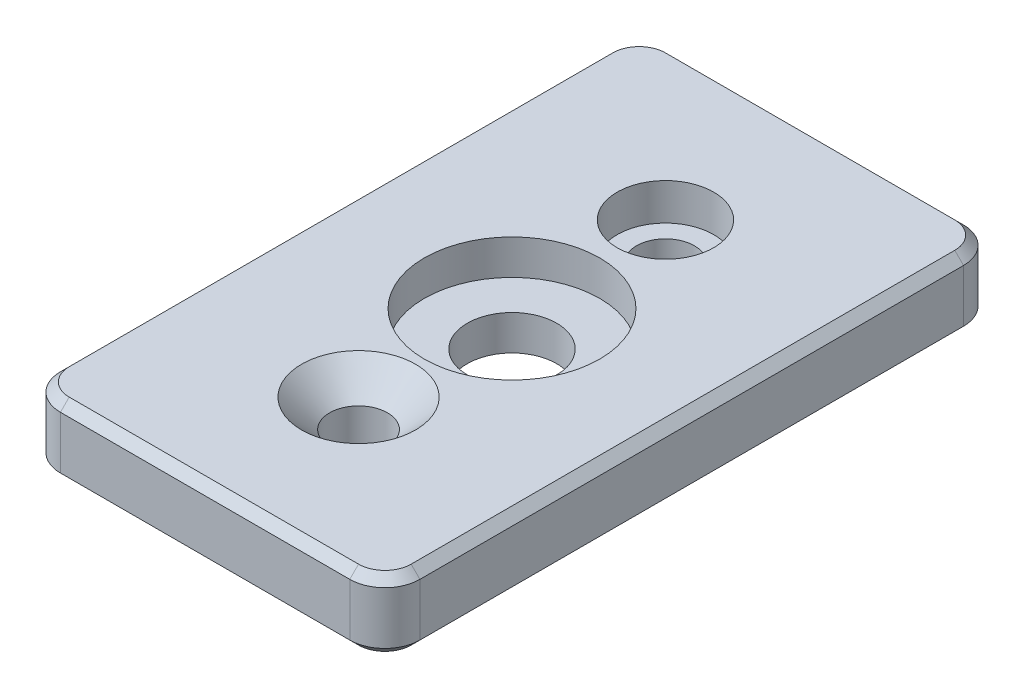
ISO-10303-21;
HEADER;
FILE_DESCRIPTION(('STEP AP214'),'2;1');
FILE_NAME('part.step','',(''),(''),'','','');
FILE_SCHEMA(('AUTOMOTIVE_DESIGN { 1 0 10303 214 1 1 1 1 }'));
ENDSEC;
DATA;
#1=APPLICATION_CONTEXT('core data for automotive mechanical design processes');
#2=APPLICATION_PROTOCOL_DEFINITION('international standard','automotive_design',2000,#1);
#3=PRODUCT_CONTEXT('',#1,'mechanical');
#4=PRODUCT('Part','Part','',(#3));
#5=PRODUCT_RELATED_PRODUCT_CATEGORY('part','',(#4));
#6=PRODUCT_DEFINITION_FORMATION('','',#4);
#7=PRODUCT_DEFINITION_CONTEXT('part definition',#1,'design');
#8=PRODUCT_DEFINITION('design','',#6,#7);
#9=PRODUCT_DEFINITION_SHAPE('','',#8);
#10=(LENGTH_UNIT() NAMED_UNIT(*) SI_UNIT(.MILLI.,.METRE.));
#11=(NAMED_UNIT(*) PLANE_ANGLE_UNIT() SI_UNIT($,.RADIAN.));
#12=(NAMED_UNIT(*) SI_UNIT($,.STERADIAN.) SOLID_ANGLE_UNIT());
#13=UNCERTAINTY_MEASURE_WITH_UNIT(LENGTH_MEASURE(1.E-05),#10,'distance_accuracy_value','');
#14=(GEOMETRIC_REPRESENTATION_CONTEXT(3) GLOBAL_UNCERTAINTY_ASSIGNED_CONTEXT((#13)) GLOBAL_UNIT_ASSIGNED_CONTEXT((#10,
#11,#12)) REPRESENTATION_CONTEXT('',''));
#15=CARTESIAN_POINT('',(0.,0.,0.));
#16=DIRECTION('',(0.,0.,1.));
#17=DIRECTION('',(1.,0.,0.));
#18=AXIS2_PLACEMENT_3D('',#15,#16,#17);
#19=CARTESIAN_POINT('',(0.,-2.,0.));
#20=DIRECTION('',(0.,1.,0.));
#21=DIRECTION('',(0.,0.,1.));
#22=AXIS2_PLACEMENT_3D('',#19,#20,#21);
#23=CYLINDRICAL_SURFACE('',#22,5.1);
#24=CARTESIAN_POINT('',(0.,0.,0.));
#25=DIRECTION('',(0.,1.,0.));
#26=DIRECTION('',(0.,0.,1.));
#27=AXIS2_PLACEMENT_3D('',#24,#25,#26);
#28=CIRCLE('',#27,5.1);
#29=CARTESIAN_POINT('',(0.,0.,5.1));
#30=VERTEX_POINT('',#29);
#31=EDGE_CURVE('E292',#30,#30,#28,.T.);
#32=ORIENTED_EDGE('',*,*,#31,.F.);
#33=EDGE_LOOP('',(#32));
#34=FACE_BOUND('',#33,.T.);
#35=CARTESIAN_POINT('',(0.,4.,0.));
#36=DIRECTION('',(0.,1.,0.));
#37=DIRECTION('',(0.,0.,1.));
#38=AXIS2_PLACEMENT_3D('',#35,#36,#37);
#39=CIRCLE('',#38,5.1);
#40=CARTESIAN_POINT('',(0.,4.,5.1));
#41=VERTEX_POINT('',#40);
#42=EDGE_CURVE('E37',#41,#41,#39,.F.);
#43=ORIENTED_EDGE('',*,*,#42,.F.);
#44=EDGE_LOOP('',(#43));
#45=FACE_BOUND('',#44,.T.);
#46=ADVANCED_FACE('F33',(#34,#45),#23,.F.);
#47=CARTESIAN_POINT('',(0.,0.,-17.5));
#48=DIRECTION('',(0.,1.,0.));
#49=DIRECTION('',(0.,0.,1.));
#50=AXIS2_PLACEMENT_3D('',#47,#48,#49);
#51=CYLINDRICAL_SURFACE('',#50,3.3);
#52=CARTESIAN_POINT('',(0.,0.,-17.5));
#53=DIRECTION('',(0.,1.,0.));
#54=DIRECTION('',(0.,0.,1.));
#55=AXIS2_PLACEMENT_3D('',#52,#53,#54);
#56=CIRCLE('',#55,3.3);
#57=CARTESIAN_POINT('',(0.,0.,-14.2));
#58=VERTEX_POINT('',#57);
#59=EDGE_CURVE('E290',#58,#58,#56,.T.);
#60=ORIENTED_EDGE('',*,*,#59,.F.);
#61=EDGE_LOOP('',(#60));
#62=FACE_BOUND('',#61,.T.);
#63=CARTESIAN_POINT('',(0.,3.8,-17.5));
#64=DIRECTION('',(0.,1.,0.));
#65=DIRECTION('',(0.,0.,1.));
#66=AXIS2_PLACEMENT_3D('',#63,#64,#65);
#67=CIRCLE('',#66,3.3);
#68=CARTESIAN_POINT('',(0.,3.8,-14.2));
#69=VERTEX_POINT('',#68);
#70=EDGE_CURVE('E288',#69,#69,#67,.F.);
#71=ORIENTED_EDGE('',*,*,#70,.F.);
#72=EDGE_LOOP('',(#71));
#73=FACE_BOUND('',#72,.T.);
#74=ADVANCED_FACE('F422',(#62,#73),#51,.F.);
#75=CARTESIAN_POINT('',(20.5,8.,-35.));
#76=DIRECTION('',(-1.,0.,0.));
#77=DIRECTION('',(0.,0.,1.));
#78=AXIS2_PLACEMENT_3D('',#75,#76,#77);
#79=PLANE('',#78);
#80=DIRECTION('',(0.,-1.,0.));
#81=VECTOR('',#80,1.);
#82=CARTESIAN_POINT('',(20.5,8.,31.));
#83=LINE('',#82,#81);
#84=CARTESIAN_POINT('',(20.5,6.99999999999999,31.));
#85=VERTEX_POINT('',#84);
#86=CARTESIAN_POINT('',(20.5,0.999999999999983,31.));
#87=VERTEX_POINT('',#86);
#88=EDGE_CURVE('E328',#85,#87,#83,.T.);
#89=ORIENTED_EDGE('',*,*,#88,.T.);
#90=DIRECTION('',(0.,0.,-1.));
#91=VECTOR('',#90,1.);
#92=CARTESIAN_POINT('',(20.5,0.999999999999983,-35.));
#93=LINE('',#92,#91);
#94=CARTESIAN_POINT('',(20.5,0.999999999999983,-31.));
#95=VERTEX_POINT('',#94);
#96=EDGE_CURVE('E210',#87,#95,#93,.T.);
#97=ORIENTED_EDGE('',*,*,#96,.T.);
#98=DIRECTION('',(0.,-1.,0.));
#99=VECTOR('',#98,1.);
#100=CARTESIAN_POINT('',(20.5,8.,-31.));
#101=LINE('',#100,#99);
#102=CARTESIAN_POINT('',(20.5,6.99999999999999,-31.));
#103=VERTEX_POINT('',#102);
#104=EDGE_CURVE('E190',#95,#103,#101,.F.);
#105=ORIENTED_EDGE('',*,*,#104,.T.);
#106=DIRECTION('',(0.,0.,1.));
#107=VECTOR('',#106,1.);
#108=CARTESIAN_POINT('',(20.5,6.99999999999999,31.));
#109=LINE('',#108,#107);
#110=EDGE_CURVE('E172',#103,#85,#109,.T.);
#111=ORIENTED_EDGE('',*,*,#110,.T.);
#112=EDGE_LOOP('',(#89,#97,#105,#111));
#113=FACE_BOUND('',#112,.T.);
#114=ADVANCED_FACE('F333',(#113),#79,.F.);
#115=CARTESIAN_POINT('',(-20.5,8.,-35.));
#116=DIRECTION('',(0.,0.,1.));
#117=DIRECTION('',(1.,0.,0.));
#118=AXIS2_PLACEMENT_3D('',#115,#116,#117);
#119=PLANE('',#118);
#120=DIRECTION('',(0.,-1.,0.));
#121=VECTOR('',#120,1.);
#122=CARTESIAN_POINT('',(16.5,8.,-35.));
#123=LINE('',#122,#121);
#124=CARTESIAN_POINT('',(16.5,6.99999999999999,-35.));
#125=VERTEX_POINT('',#124);
#126=CARTESIAN_POINT('',(16.5,0.999999999999983,-35.));
#127=VERTEX_POINT('',#126);
#128=EDGE_CURVE('E322',#125,#127,#123,.T.);
#129=ORIENTED_EDGE('',*,*,#128,.T.);
#130=DIRECTION('',(-1.,0.,0.));
#131=VECTOR('',#130,1.);
#132=CARTESIAN_POINT('',(-20.5,0.999999999999983,-35.));
#133=LINE('',#132,#131);
#134=CARTESIAN_POINT('',(-16.5,0.999999999999983,-35.));
#135=VERTEX_POINT('',#134);
#136=EDGE_CURVE('E218',#127,#135,#133,.T.);
#137=ORIENTED_EDGE('',*,*,#136,.T.);
#138=DIRECTION('',(0.,-1.,0.));
#139=VECTOR('',#138,1.);
#140=CARTESIAN_POINT('',(-16.5,8.,-35.));
#141=LINE('',#140,#139);
#142=CARTESIAN_POINT('',(-16.5,6.99999999999999,-35.));
#143=VERTEX_POINT('',#142);
#144=EDGE_CURVE('E325',#135,#143,#141,.F.);
#145=ORIENTED_EDGE('',*,*,#144,.T.);
#146=DIRECTION('',(1.,0.,0.));
#147=VECTOR('',#146,1.);
#148=CARTESIAN_POINT('',(16.5,6.99999999999999,-35.));
#149=LINE('',#148,#147);
#150=EDGE_CURVE('E216',#143,#125,#149,.T.);
#151=ORIENTED_EDGE('',*,*,#150,.T.);
#152=EDGE_LOOP('',(#129,#137,#145,#151));
#153=FACE_BOUND('',#152,.T.);
#154=ADVANCED_FACE('F385',(#153),#119,.F.);
#155=CARTESIAN_POINT('',(-20.5,8.,-35.));
#156=DIRECTION('',(1.,0.,0.));
#157=DIRECTION('',(0.,0.,-1.));
#158=AXIS2_PLACEMENT_3D('',#155,#156,#157);
#159=PLANE('',#158);
#160=DIRECTION('',(0.,-1.,0.));
#161=VECTOR('',#160,1.);
#162=CARTESIAN_POINT('',(-20.5,8.,-31.));
#163=LINE('',#162,#161);
#164=CARTESIAN_POINT('',(-20.5,6.99999999999999,-31.));
#165=VERTEX_POINT('',#164);
#166=CARTESIAN_POINT('',(-20.5,0.999999999999983,-31.));
#167=VERTEX_POINT('',#166);
#168=EDGE_CURVE('E319',#165,#167,#163,.T.);
#169=ORIENTED_EDGE('',*,*,#168,.T.);
#170=DIRECTION('',(0.,0.,1.));
#171=VECTOR('',#170,1.);
#172=CARTESIAN_POINT('',(-20.5,0.999999999999983,-35.));
#173=LINE('',#172,#171);
#174=CARTESIAN_POINT('',(-20.5,0.999999999999983,31.));
#175=VERTEX_POINT('',#174);
#176=EDGE_CURVE('E226',#167,#175,#173,.T.);
#177=ORIENTED_EDGE('',*,*,#176,.T.);
#178=DIRECTION('',(0.,-1.,0.));
#179=VECTOR('',#178,1.);
#180=CARTESIAN_POINT('',(-20.5,8.,31.));
#181=LINE('',#180,#179);
#182=CARTESIAN_POINT('',(-20.5,6.99999999999999,31.));
#183=VERTEX_POINT('',#182);
#184=EDGE_CURVE('E264',#175,#183,#181,.F.);
#185=ORIENTED_EDGE('',*,*,#184,.T.);
#186=DIRECTION('',(0.,0.,-1.));
#187=VECTOR('',#186,1.);
#188=CARTESIAN_POINT('',(-20.5,6.99999999999999,-31.));
#189=LINE('',#188,#187);
#190=EDGE_CURVE('E224',#183,#165,#189,.T.);
#191=ORIENTED_EDGE('',*,*,#190,.T.);
#192=EDGE_LOOP('',(#169,#177,#185,#191));
#193=FACE_BOUND('',#192,.T.);
#194=ADVANCED_FACE('F367',(#193),#159,.F.);
#195=CARTESIAN_POINT('',(-20.5,8.,35.));
#196=DIRECTION('',(0.,0.,-1.));
#197=DIRECTION('',(-1.,0.,0.));
#198=AXIS2_PLACEMENT_3D('',#195,#196,#197);
#199=PLANE('',#198);
#200=DIRECTION('',(0.,-1.,0.));
#201=VECTOR('',#200,1.);
#202=CARTESIAN_POINT('',(-16.5,8.,35.));
#203=LINE('',#202,#201);
#204=CARTESIAN_POINT('',(-16.5,6.99999999999999,35.));
#205=VERTEX_POINT('',#204);
#206=CARTESIAN_POINT('',(-16.5,0.999999999999983,35.));
#207=VERTEX_POINT('',#206);
#208=EDGE_CURVE('E181',#205,#207,#203,.T.);
#209=ORIENTED_EDGE('',*,*,#208,.T.);
#210=DIRECTION('',(1.,0.,0.));
#211=VECTOR('',#210,1.);
#212=CARTESIAN_POINT('',(-20.5,0.999999999999983,35.));
#213=LINE('',#212,#211);
#214=CARTESIAN_POINT('',(16.5,0.999999999999983,35.));
#215=VERTEX_POINT('',#214);
#216=EDGE_CURVE('E155',#207,#215,#213,.T.);
#217=ORIENTED_EDGE('',*,*,#216,.T.);
#218=DIRECTION('',(0.,-1.,0.));
#219=VECTOR('',#218,1.);
#220=CARTESIAN_POINT('',(16.5,8.,35.));
#221=LINE('',#220,#219);
#222=CARTESIAN_POINT('',(16.5,6.99999999999999,35.));
#223=VERTEX_POINT('',#222);
#224=EDGE_CURVE('E179',#215,#223,#221,.F.);
#225=ORIENTED_EDGE('',*,*,#224,.T.);
#226=DIRECTION('',(-1.,0.,0.));
#227=VECTOR('',#226,1.);
#228=CARTESIAN_POINT('',(-16.5,6.99999999999999,35.));
#229=LINE('',#228,#227);
#230=EDGE_CURVE('E184',#223,#205,#229,.T.);
#231=ORIENTED_EDGE('',*,*,#230,.T.);
#232=EDGE_LOOP('',(#209,#217,#225,#231));
#233=FACE_BOUND('',#232,.T.);
#234=ADVANCED_FACE('F178',(#233),#199,.F.);
#235=CARTESIAN_POINT('',(0.,8.,0.));
#236=DIRECTION('',(0.,1.,0.));
#237=DIRECTION('',(0.,0.,1.));
#238=AXIS2_PLACEMENT_3D('',#235,#236,#237);
#239=PLANE('',#238);
#240=CARTESIAN_POINT('',(0.,8.,0.));
#241=DIRECTION('',(0.,1.,0.));
#242=DIRECTION('',(0.,0.,1.));
#243=AXIS2_PLACEMENT_3D('',#240,#241,#242);
#244=CIRCLE('',#243,10.);
#245=CARTESIAN_POINT('',(0.,8.,10.));
#246=VERTEX_POINT('',#245);
#247=EDGE_CURVE('E304',#246,#246,#244,.T.);
#248=ORIENTED_EDGE('',*,*,#247,.F.);
#249=EDGE_LOOP('',(#248));
#250=FACE_BOUND('',#249,.T.);
#251=CARTESIAN_POINT('',(0.,8.,-17.5));
#252=DIRECTION('',(0.,1.,0.));
#253=DIRECTION('',(0.,0.,1.));
#254=AXIS2_PLACEMENT_3D('',#251,#252,#253);
#255=CIRCLE('',#254,5.5);
#256=CARTESIAN_POINT('',(0.,8.,-12.));
#257=VERTEX_POINT('',#256);
#258=EDGE_CURVE('E294',#257,#257,#255,.T.);
#259=ORIENTED_EDGE('',*,*,#258,.F.);
#260=EDGE_LOOP('',(#259));
#261=FACE_BOUND('',#260,.T.);
#262=CARTESIAN_POINT('',(0.,8.,17.5));
#263=DIRECTION('',(0.,1.,0.));
#264=DIRECTION('',(0.,0.,1.));
#265=AXIS2_PLACEMENT_3D('',#262,#263,#264);
#266=CIRCLE('',#265,6.50000000000001);
#267=CARTESIAN_POINT('',(0.,8.,24.));
#268=VERTEX_POINT('',#267);
#269=EDGE_CURVE('E11',#268,#268,#266,.F.);
#270=ORIENTED_EDGE('',*,*,#269,.T.);
#271=EDGE_LOOP('',(#270));
#272=FACE_BOUND('',#271,.T.);
#273=DIRECTION('',(1.,0.,0.));
#274=VECTOR('',#273,1.);
#275=CARTESIAN_POINT('',(16.5,8.,34.));
#276=LINE('',#275,#274);
#277=CARTESIAN_POINT('',(-16.5,8.,34.));
#278=VERTEX_POINT('',#277);
#279=CARTESIAN_POINT('',(16.5,8.,34.));
#280=VERTEX_POINT('',#279);
#281=EDGE_CURVE('E232',#278,#280,#276,.T.);
#282=ORIENTED_EDGE('',*,*,#281,.T.);
#283=CARTESIAN_POINT('',(16.5,8.,31.));
#284=DIRECTION('',(0.,1.,0.));
#285=DIRECTION('',(0.,0.,1.));
#286=AXIS2_PLACEMENT_3D('',#283,#284,#285);
#287=CIRCLE('',#286,3.00000000000001);
#288=CARTESIAN_POINT('',(19.5,8.,31.));
#289=VERTEX_POINT('',#288);
#290=EDGE_CURVE('E245',#280,#289,#287,.T.);
#291=ORIENTED_EDGE('',*,*,#290,.T.);
#292=DIRECTION('',(0.,0.,-1.));
#293=VECTOR('',#292,1.);
#294=CARTESIAN_POINT('',(19.5,8.,-31.));
#295=LINE('',#294,#293);
#296=CARTESIAN_POINT('',(19.5,8.,-31.));
#297=VERTEX_POINT('',#296);
#298=EDGE_CURVE('E57',#289,#297,#295,.T.);
#299=ORIENTED_EDGE('',*,*,#298,.T.);
#300=CARTESIAN_POINT('',(16.5,8.,-31.));
#301=DIRECTION('',(0.,1.,0.));
#302=DIRECTION('',(0.,0.,1.));
#303=AXIS2_PLACEMENT_3D('',#300,#301,#302);
#304=CIRCLE('',#303,3.00000000000001);
#305=CARTESIAN_POINT('',(16.5,8.,-34.));
#306=VERTEX_POINT('',#305);
#307=EDGE_CURVE('E242',#297,#306,#304,.T.);
#308=ORIENTED_EDGE('',*,*,#307,.T.);
#309=DIRECTION('',(-1.,0.,0.));
#310=VECTOR('',#309,1.);
#311=CARTESIAN_POINT('',(-16.5,8.,-34.));
#312=LINE('',#311,#310);
#313=CARTESIAN_POINT('',(-16.5,8.,-34.));
#314=VERTEX_POINT('',#313);
#315=EDGE_CURVE('E240',#306,#314,#312,.T.);
#316=ORIENTED_EDGE('',*,*,#315,.T.);
#317=CARTESIAN_POINT('',(-16.5,8.,-31.));
#318=DIRECTION('',(0.,1.,0.));
#319=DIRECTION('',(0.,0.,1.));
#320=AXIS2_PLACEMENT_3D('',#317,#318,#319);
#321=CIRCLE('',#320,3.00000000000001);
#322=CARTESIAN_POINT('',(-19.5,8.,-31.));
#323=VERTEX_POINT('',#322);
#324=EDGE_CURVE('E238',#314,#323,#321,.T.);
#325=ORIENTED_EDGE('',*,*,#324,.T.);
#326=DIRECTION('',(0.,0.,1.));
#327=VECTOR('',#326,1.);
#328=CARTESIAN_POINT('',(-19.5,8.,31.));
#329=LINE('',#328,#327);
#330=CARTESIAN_POINT('',(-19.5,8.,31.));
#331=VERTEX_POINT('',#330);
#332=EDGE_CURVE('E236',#323,#331,#329,.T.);
#333=ORIENTED_EDGE('',*,*,#332,.T.);
#334=CARTESIAN_POINT('',(-16.5,8.,31.));
#335=DIRECTION('',(0.,1.,0.));
#336=DIRECTION('',(0.,0.,1.));
#337=AXIS2_PLACEMENT_3D('',#334,#335,#336);
#338=CIRCLE('',#337,3.00000000000001);
#339=EDGE_CURVE('E234',#331,#278,#338,.T.);
#340=ORIENTED_EDGE('',*,*,#339,.T.);
#341=EDGE_LOOP('',(#282,#291,#299,#308,#316,#325,#333,#340));
#342=FACE_BOUND('',#341,.T.);
#343=ADVANCED_FACE('F343',(#250,#261,#272,#342),#239,.T.);
#344=CARTESIAN_POINT('',(0.,0.,0.));
#345=DIRECTION('',(0.,1.,0.));
#346=DIRECTION('',(0.,0.,1.));
#347=AXIS2_PLACEMENT_3D('',#344,#345,#346);
#348=PLANE('',#347);
#349=ORIENTED_EDGE('',*,*,#31,.T.);
#350=EDGE_LOOP('',(#349));
#351=FACE_BOUND('',#350,.T.);
#352=CARTESIAN_POINT('',(0.,0.,17.5));
#353=DIRECTION('',(0.,1.,0.));
#354=DIRECTION('',(0.,0.,1.));
#355=AXIS2_PLACEMENT_3D('',#352,#353,#354);
#356=CIRCLE('',#355,3.3);
#357=CARTESIAN_POINT('',(0.,0.,20.8));
#358=VERTEX_POINT('',#357);
#359=EDGE_CURVE('E267',#358,#358,#356,.T.);
#360=ORIENTED_EDGE('',*,*,#359,.T.);
#361=EDGE_LOOP('',(#360));
#362=FACE_BOUND('',#361,.T.);
#363=ORIENTED_EDGE('',*,*,#59,.T.);
#364=EDGE_LOOP('',(#363));
#365=FACE_BOUND('',#364,.T.);
#366=CARTESIAN_POINT('',(16.5,0.,31.));
#367=DIRECTION('',(0.,1.,0.));
#368=DIRECTION('',(0.,0.,1.));
#369=AXIS2_PLACEMENT_3D('',#366,#367,#368);
#370=CIRCLE('',#369,3.00000000000002);
#371=CARTESIAN_POINT('',(19.5,0.,31.));
#372=VERTEX_POINT('',#371);
#373=CARTESIAN_POINT('',(16.5,0.,34.));
#374=VERTEX_POINT('',#373);
#375=EDGE_CURVE('E205',#372,#374,#370,.F.);
#376=ORIENTED_EDGE('',*,*,#375,.T.);
#377=DIRECTION('',(-1.,0.,0.));
#378=VECTOR('',#377,1.);
#379=CARTESIAN_POINT('',(0.,0.,34.));
#380=LINE('',#379,#378);
#381=CARTESIAN_POINT('',(-16.5,0.,34.));
#382=VERTEX_POINT('',#381);
#383=EDGE_CURVE('E157',#374,#382,#380,.T.);
#384=ORIENTED_EDGE('',*,*,#383,.T.);
#385=CARTESIAN_POINT('',(-16.5,0.,31.));
#386=DIRECTION('',(0.,1.,0.));
#387=DIRECTION('',(0.,0.,1.));
#388=AXIS2_PLACEMENT_3D('',#385,#386,#387);
#389=CIRCLE('',#388,3.00000000000002);
#390=CARTESIAN_POINT('',(-19.5,0.,31.));
#391=VERTEX_POINT('',#390);
#392=EDGE_CURVE('E183',#382,#391,#389,.F.);
#393=ORIENTED_EDGE('',*,*,#392,.T.);
#394=DIRECTION('',(0.,0.,-1.));
#395=VECTOR('',#394,1.);
#396=CARTESIAN_POINT('',(-19.5,0.,0.));
#397=LINE('',#396,#395);
#398=CARTESIAN_POINT('',(-19.5,0.,-31.));
#399=VERTEX_POINT('',#398);
#400=EDGE_CURVE('E195',#391,#399,#397,.T.);
#401=ORIENTED_EDGE('',*,*,#400,.T.);
#402=CARTESIAN_POINT('',(-16.5,0.,-31.));
#403=DIRECTION('',(0.,1.,0.));
#404=DIRECTION('',(0.,0.,1.));
#405=AXIS2_PLACEMENT_3D('',#402,#403,#404);
#406=CIRCLE('',#405,3.00000000000001);
#407=CARTESIAN_POINT('',(-16.5,0.,-34.));
#408=VERTEX_POINT('',#407);
#409=EDGE_CURVE('E197',#399,#408,#406,.F.);
#410=ORIENTED_EDGE('',*,*,#409,.T.);
#411=DIRECTION('',(1.,0.,0.));
#412=VECTOR('',#411,1.);
#413=CARTESIAN_POINT('',(0.,0.,-34.));
#414=LINE('',#413,#412);
#415=CARTESIAN_POINT('',(16.5,0.,-34.));
#416=VERTEX_POINT('',#415);
#417=EDGE_CURVE('E199',#408,#416,#414,.T.);
#418=ORIENTED_EDGE('',*,*,#417,.T.);
#419=CARTESIAN_POINT('',(16.5,0.,-31.));
#420=DIRECTION('',(0.,1.,0.));
#421=DIRECTION('',(0.,0.,1.));
#422=AXIS2_PLACEMENT_3D('',#419,#420,#421);
#423=CIRCLE('',#422,3.00000000000002);
#424=CARTESIAN_POINT('',(19.5,0.,-31.));
#425=VERTEX_POINT('',#424);
#426=EDGE_CURVE('E201',#416,#425,#423,.F.);
#427=ORIENTED_EDGE('',*,*,#426,.T.);
#428=DIRECTION('',(0.,0.,1.));
#429=VECTOR('',#428,1.);
#430=CARTESIAN_POINT('',(19.5,0.,0.));
#431=LINE('',#430,#429);
#432=EDGE_CURVE('E203',#425,#372,#431,.T.);
#433=ORIENTED_EDGE('',*,*,#432,.T.);
#434=EDGE_LOOP('',(#376,#384,#393,#401,#410,#418,#427,#433));
#435=FACE_BOUND('',#434,.T.);
#436=ADVANCED_FACE('F397',(#351,#362,#365,#435),#348,.F.);
#437=CARTESIAN_POINT('',(-16.5,8.,-31.));
#438=DIRECTION('',(0.,-1.,0.));
#439=DIRECTION('',(0.,0.,-1.));
#440=AXIS2_PLACEMENT_3D('',#437,#438,#439);
#441=CYLINDRICAL_SURFACE('',#440,4.);
#442=ORIENTED_EDGE('',*,*,#144,.F.);
#443=CARTESIAN_POINT('',(-16.5,0.999999999999983,-31.));
#444=DIRECTION('',(0.,1.,0.));
#445=DIRECTION('',(0.,0.,1.));
#446=AXIS2_PLACEMENT_3D('',#443,#444,#445);
#447=CIRCLE('',#446,4.);
#448=EDGE_CURVE('E222',#135,#167,#447,.T.);
#449=ORIENTED_EDGE('',*,*,#448,.T.);
#450=ORIENTED_EDGE('',*,*,#168,.F.);
#451=CARTESIAN_POINT('',(-16.5,6.99999999999999,-31.));
#452=DIRECTION('',(0.,1.,0.));
#453=DIRECTION('',(0.,0.,1.));
#454=AXIS2_PLACEMENT_3D('',#451,#452,#453);
#455=CIRCLE('',#454,4.);
#456=EDGE_CURVE('E220',#165,#143,#455,.F.);
#457=ORIENTED_EDGE('',*,*,#456,.T.);
#458=EDGE_LOOP('',(#442,#449,#450,#457));
#459=FACE_BOUND('',#458,.T.);
#460=ADVANCED_FACE('F372',(#459),#441,.T.);
#461=CARTESIAN_POINT('',(16.5,8.,-31.));
#462=DIRECTION('',(0.,-1.,0.));
#463=DIRECTION('',(0.,0.,-1.));
#464=AXIS2_PLACEMENT_3D('',#461,#462,#463);
#465=CYLINDRICAL_SURFACE('',#464,4.);
#466=ORIENTED_EDGE('',*,*,#104,.F.);
#467=CARTESIAN_POINT('',(16.5,0.999999999999983,-31.));
#468=DIRECTION('',(0.,1.,0.));
#469=DIRECTION('',(0.,0.,1.));
#470=AXIS2_PLACEMENT_3D('',#467,#468,#469);
#471=CIRCLE('',#470,4.);
#472=EDGE_CURVE('E214',#95,#127,#471,.T.);
#473=ORIENTED_EDGE('',*,*,#472,.T.);
#474=ORIENTED_EDGE('',*,*,#128,.F.);
#475=CARTESIAN_POINT('',(16.5,6.99999999999999,-31.));
#476=DIRECTION('',(0.,1.,0.));
#477=DIRECTION('',(0.,0.,1.));
#478=AXIS2_PLACEMENT_3D('',#475,#476,#477);
#479=CIRCLE('',#478,4.);
#480=EDGE_CURVE('E212',#125,#103,#479,.F.);
#481=ORIENTED_EDGE('',*,*,#480,.T.);
#482=EDGE_LOOP('',(#466,#473,#474,#481));
#483=FACE_BOUND('',#482,.T.);
#484=ADVANCED_FACE('F387',(#483),#465,.T.);
#485=CARTESIAN_POINT('',(16.5,8.,31.));
#486=DIRECTION('',(0.,-1.,0.));
#487=DIRECTION('',(0.,0.,-1.));
#488=AXIS2_PLACEMENT_3D('',#485,#486,#487);
#489=CYLINDRICAL_SURFACE('',#488,4.);
#490=ORIENTED_EDGE('',*,*,#224,.F.);
#491=CARTESIAN_POINT('',(16.5,0.999999999999983,31.));
#492=DIRECTION('',(0.,1.,0.));
#493=DIRECTION('',(0.,0.,1.));
#494=AXIS2_PLACEMENT_3D('',#491,#492,#493);
#495=CIRCLE('',#494,4.);
#496=EDGE_CURVE('E164',#215,#87,#495,.T.);
#497=ORIENTED_EDGE('',*,*,#496,.T.);
#498=ORIENTED_EDGE('',*,*,#88,.F.);
#499=CARTESIAN_POINT('',(16.5,6.99999999999999,31.));
#500=DIRECTION('',(0.,1.,0.));
#501=DIRECTION('',(0.,0.,1.));
#502=AXIS2_PLACEMENT_3D('',#499,#500,#501);
#503=CIRCLE('',#502,4.);
#504=EDGE_CURVE('E173',#85,#223,#503,.F.);
#505=ORIENTED_EDGE('',*,*,#504,.T.);
#506=EDGE_LOOP('',(#490,#497,#498,#505));
#507=FACE_BOUND('',#506,.T.);
#508=ADVANCED_FACE('F187',(#507),#489,.T.);
#509=CARTESIAN_POINT('',(-16.5,8.,31.));
#510=DIRECTION('',(0.,-1.,0.));
#511=DIRECTION('',(0.,0.,-1.));
#512=AXIS2_PLACEMENT_3D('',#509,#510,#511);
#513=CYLINDRICAL_SURFACE('',#512,4.);
#514=ORIENTED_EDGE('',*,*,#184,.F.);
#515=CARTESIAN_POINT('',(-16.5,0.999999999999983,31.));
#516=DIRECTION('',(0.,1.,0.));
#517=DIRECTION('',(0.,0.,1.));
#518=AXIS2_PLACEMENT_3D('',#515,#516,#517);
#519=CIRCLE('',#518,4.);
#520=EDGE_CURVE('E230',#175,#207,#519,.T.);
#521=ORIENTED_EDGE('',*,*,#520,.T.);
#522=ORIENTED_EDGE('',*,*,#208,.F.);
#523=CARTESIAN_POINT('',(-16.5,6.99999999999999,31.));
#524=DIRECTION('',(0.,1.,0.));
#525=DIRECTION('',(0.,0.,1.));
#526=AXIS2_PLACEMENT_3D('',#523,#524,#525);
#527=CIRCLE('',#526,4.);
#528=EDGE_CURVE('E228',#205,#183,#527,.F.);
#529=ORIENTED_EDGE('',*,*,#528,.T.);
#530=EDGE_LOOP('',(#514,#521,#522,#529));
#531=FACE_BOUND('',#530,.T.);
#532=ADVANCED_FACE('F354',(#531),#513,.T.);
#533=CARTESIAN_POINT('',(-20.5,0.999999999999983,-35.));
#534=DIRECTION('',(0.,0.707106781186549,0.707106781186546));
#535=DIRECTION('',(-1.,0.,0.));
#536=AXIS2_PLACEMENT_3D('',#533,#534,#535);
#537=PLANE('',#536);
#538=DIRECTION('',(0.,0.707106781186546,-0.707106781186549));
#539=VECTOR('',#538,1.);
#540=CARTESIAN_POINT('',(16.5,0.,-34.));
#541=LINE('',#540,#539);
#542=EDGE_CURVE('E258',#416,#127,#541,.T.);
#543=ORIENTED_EDGE('',*,*,#542,.F.);
#544=ORIENTED_EDGE('',*,*,#417,.F.);
#545=DIRECTION('',(0.,-0.707106781186546,0.707106781186549));
#546=VECTOR('',#545,1.);
#547=CARTESIAN_POINT('',(-16.5,0.999999999999983,-35.));
#548=LINE('',#547,#546);
#549=EDGE_CURVE('E261',#135,#408,#548,.T.);
#550=ORIENTED_EDGE('',*,*,#549,.F.);
#551=ORIENTED_EDGE('',*,*,#136,.F.);
#552=EDGE_LOOP('',(#543,#544,#550,#551));
#553=FACE_BOUND('',#552,.T.);
#554=ADVANCED_FACE('F402',(#553),#537,.F.);
#555=CARTESIAN_POINT('',(-16.5,0.,-31.));
#556=DIRECTION('',(0.,1.,0.));
#557=DIRECTION('',(0.,0.,1.));
#558=AXIS2_PLACEMENT_3D('',#555,#556,#557);
#559=CONICAL_SURFACE('',#558,3.00000000000001,0.78539816339745);
#560=ORIENTED_EDGE('',*,*,#549,.T.);
#561=ORIENTED_EDGE('',*,*,#409,.F.);
#562=DIRECTION('',(0.707106781186549,-0.707106781186546,0.));
#563=VECTOR('',#562,1.);
#564=CARTESIAN_POINT('',(-20.5,0.999999999999983,-31.));
#565=LINE('',#564,#563);
#566=EDGE_CURVE('E255',#167,#399,#565,.T.);
#567=ORIENTED_EDGE('',*,*,#566,.F.);
#568=ORIENTED_EDGE('',*,*,#448,.F.);
#569=EDGE_LOOP('',(#560,#561,#567,#568));
#570=FACE_BOUND('',#569,.T.);
#571=ADVANCED_FACE('F404',(#570),#559,.T.);
#572=CARTESIAN_POINT('',(16.5,0.,-31.));
#573=DIRECTION('',(0.,1.,0.));
#574=DIRECTION('',(0.,0.,1.));
#575=AXIS2_PLACEMENT_3D('',#572,#573,#574);
#576=CONICAL_SURFACE('',#575,3.00000000000002,0.785398163397449);
#577=ORIENTED_EDGE('',*,*,#542,.T.);
#578=ORIENTED_EDGE('',*,*,#472,.F.);
#579=DIRECTION('',(0.707106781186548,0.707106781186547,0.));
#580=VECTOR('',#579,1.);
#581=CARTESIAN_POINT('',(19.5,0.,-31.));
#582=LINE('',#581,#580);
#583=EDGE_CURVE('E252',#425,#95,#582,.T.);
#584=ORIENTED_EDGE('',*,*,#583,.F.);
#585=ORIENTED_EDGE('',*,*,#426,.F.);
#586=EDGE_LOOP('',(#577,#578,#584,#585));
#587=FACE_BOUND('',#586,.T.);
#588=ADVANCED_FACE('F390',(#587),#576,.T.);
#589=CARTESIAN_POINT('',(-20.5,0.999999999999983,-35.));
#590=DIRECTION('',(0.707106781186547,0.707106781186548,0.));
#591=DIRECTION('',(0.,0.,1.));
#592=AXIS2_PLACEMENT_3D('',#589,#590,#591);
#593=PLANE('',#592);
#594=ORIENTED_EDGE('',*,*,#566,.T.);
#595=ORIENTED_EDGE('',*,*,#400,.F.);
#596=DIRECTION('',(0.707106781186548,-0.707106781186547,0.));
#597=VECTOR('',#596,1.);
#598=CARTESIAN_POINT('',(-20.5,0.999999999999983,31.));
#599=LINE('',#598,#597);
#600=EDGE_CURVE('E249',#175,#391,#599,.T.);
#601=ORIENTED_EDGE('',*,*,#600,.F.);
#602=ORIENTED_EDGE('',*,*,#176,.F.);
#603=EDGE_LOOP('',(#594,#595,#601,#602));
#604=FACE_BOUND('',#603,.T.);
#605=ADVANCED_FACE('F409',(#604),#593,.F.);
#606=CARTESIAN_POINT('',(20.5,0.999999999999983,-35.));
#607=DIRECTION('',(-0.707106781186547,0.707106781186548,0.));
#608=DIRECTION('',(0.,0.,-1.));
#609=AXIS2_PLACEMENT_3D('',#606,#607,#608);
#610=PLANE('',#609);
#611=ORIENTED_EDGE('',*,*,#583,.T.);
#612=ORIENTED_EDGE('',*,*,#96,.F.);
#613=DIRECTION('',(0.707106781186548,0.707106781186547,0.));
#614=VECTOR('',#613,1.);
#615=CARTESIAN_POINT('',(19.5,0.,31.));
#616=LINE('',#615,#614);
#617=EDGE_CURVE('E167',#372,#87,#616,.T.);
#618=ORIENTED_EDGE('',*,*,#617,.F.);
#619=ORIENTED_EDGE('',*,*,#432,.F.);
#620=EDGE_LOOP('',(#611,#612,#618,#619));
#621=FACE_BOUND('',#620,.T.);
#622=ADVANCED_FACE('F395',(#621),#610,.F.);
#623=CARTESIAN_POINT('',(-16.5,0.,31.));
#624=DIRECTION('',(0.,1.,0.));
#625=DIRECTION('',(0.,0.,1.));
#626=AXIS2_PLACEMENT_3D('',#623,#624,#625);
#627=CONICAL_SURFACE('',#626,3.00000000000002,0.785398163397449);
#628=ORIENTED_EDGE('',*,*,#600,.T.);
#629=ORIENTED_EDGE('',*,*,#392,.F.);
#630=DIRECTION('',(0.,-0.707106781186546,-0.707106781186549));
#631=VECTOR('',#630,1.);
#632=CARTESIAN_POINT('',(-16.5,0.999999999999983,35.));
#633=LINE('',#632,#631);
#634=EDGE_CURVE('E160',#207,#382,#633,.T.);
#635=ORIENTED_EDGE('',*,*,#634,.F.);
#636=ORIENTED_EDGE('',*,*,#520,.F.);
#637=EDGE_LOOP('',(#628,#629,#635,#636));
#638=FACE_BOUND('',#637,.T.);
#639=ADVANCED_FACE('F412',(#638),#627,.T.);
#640=CARTESIAN_POINT('',(16.5,0.,31.));
#641=DIRECTION('',(0.,1.,0.));
#642=DIRECTION('',(0.,0.,1.));
#643=AXIS2_PLACEMENT_3D('',#640,#641,#642);
#644=CONICAL_SURFACE('',#643,3.00000000000002,0.785398163397449);
#645=ORIENTED_EDGE('',*,*,#617,.T.);
#646=ORIENTED_EDGE('',*,*,#496,.F.);
#647=DIRECTION('',(0.,0.707106781186546,0.707106781186549));
#648=VECTOR('',#647,1.);
#649=CARTESIAN_POINT('',(16.5,0.,34.));
#650=LINE('',#649,#648);
#651=EDGE_CURVE('E151',#374,#215,#650,.T.);
#652=ORIENTED_EDGE('',*,*,#651,.F.);
#653=ORIENTED_EDGE('',*,*,#375,.F.);
#654=EDGE_LOOP('',(#645,#646,#652,#653));
#655=FACE_BOUND('',#654,.T.);
#656=ADVANCED_FACE('F165',(#655),#644,.T.);
#657=CARTESIAN_POINT('',(-20.5,0.999999999999983,35.));
#658=DIRECTION('',(0.,0.707106781186549,-0.707106781186546));
#659=DIRECTION('',(1.,0.,0.));
#660=AXIS2_PLACEMENT_3D('',#657,#658,#659);
#661=PLANE('',#660);
#662=ORIENTED_EDGE('',*,*,#634,.T.);
#663=ORIENTED_EDGE('',*,*,#383,.F.);
#664=ORIENTED_EDGE('',*,*,#651,.T.);
#665=ORIENTED_EDGE('',*,*,#216,.F.);
#666=EDGE_LOOP('',(#662,#663,#664,#665));
#667=FACE_BOUND('',#666,.T.);
#668=ADVANCED_FACE('F153',(#667),#661,.F.);
#669=CARTESIAN_POINT('',(-16.5,8.,-31.));
#670=DIRECTION('',(0.,-1.,0.));
#671=DIRECTION('',(0.,0.,-1.));
#672=AXIS2_PLACEMENT_3D('',#669,#670,#671);
#673=CONICAL_SURFACE('',#672,3.00000000000001,0.785398163397441);
#674=DIRECTION('',(0.,0.707106781186552,0.707106781186543));
#675=VECTOR('',#674,1.);
#676=CARTESIAN_POINT('',(-16.5,6.99999999999999,-35.));
#677=LINE('',#676,#675);
#678=EDGE_CURVE('E281',#143,#314,#677,.T.);
#679=ORIENTED_EDGE('',*,*,#678,.F.);
#680=ORIENTED_EDGE('',*,*,#456,.F.);
#681=DIRECTION('',(-0.707106781186543,-0.707106781186552,0.));
#682=VECTOR('',#681,1.);
#683=CARTESIAN_POINT('',(-19.5,8.,-31.));
#684=LINE('',#683,#682);
#685=EDGE_CURVE('E161',#323,#165,#684,.T.);
#686=ORIENTED_EDGE('',*,*,#685,.F.);
#687=ORIENTED_EDGE('',*,*,#324,.F.);
#688=EDGE_LOOP('',(#679,#680,#686,#687));
#689=FACE_BOUND('',#688,.T.);
#690=ADVANCED_FACE('F376',(#689),#673,.T.);
#691=CARTESIAN_POINT('',(-19.5,8.,0.));
#692=DIRECTION('',(-0.707106781186552,0.707106781186543,0.));
#693=DIRECTION('',(0.,0.,-1.));
#694=AXIS2_PLACEMENT_3D('',#691,#692,#693);
#695=PLANE('',#694);
#696=ORIENTED_EDGE('',*,*,#685,.T.);
#697=ORIENTED_EDGE('',*,*,#190,.F.);
#698=DIRECTION('',(-0.707106781186543,-0.707106781186552,0.));
#699=VECTOR('',#698,1.);
#700=CARTESIAN_POINT('',(-19.5,8.,31.));
#701=LINE('',#700,#699);
#702=EDGE_CURVE('E278',#331,#183,#701,.T.);
#703=ORIENTED_EDGE('',*,*,#702,.F.);
#704=ORIENTED_EDGE('',*,*,#332,.F.);
#705=EDGE_LOOP('',(#696,#697,#703,#704));
#706=FACE_BOUND('',#705,.T.);
#707=ADVANCED_FACE('F363',(#706),#695,.T.);
#708=CARTESIAN_POINT('',(0.,8.,-34.));
#709=DIRECTION('',(0.,0.707106781186543,-0.707106781186552));
#710=DIRECTION('',(1.,0.,0.));
#711=AXIS2_PLACEMENT_3D('',#708,#709,#710);
#712=PLANE('',#711);
#713=ORIENTED_EDGE('',*,*,#678,.T.);
#714=ORIENTED_EDGE('',*,*,#315,.F.);
#715=DIRECTION('',(0.,0.707106781186552,0.707106781186543));
#716=VECTOR('',#715,1.);
#717=CARTESIAN_POINT('',(16.5,6.99999999999999,-35.));
#718=LINE('',#717,#716);
#719=EDGE_CURVE('E275',#125,#306,#718,.T.);
#720=ORIENTED_EDGE('',*,*,#719,.F.);
#721=ORIENTED_EDGE('',*,*,#150,.F.);
#722=EDGE_LOOP('',(#713,#714,#720,#721));
#723=FACE_BOUND('',#722,.T.);
#724=ADVANCED_FACE('F382',(#723),#712,.T.);
#725=CARTESIAN_POINT('',(-16.5,8.,31.));
#726=DIRECTION('',(0.,-1.,0.));
#727=DIRECTION('',(0.,0.,-1.));
#728=AXIS2_PLACEMENT_3D('',#725,#726,#727);
#729=CONICAL_SURFACE('',#728,3.00000000000001,0.785398163397441);
#730=ORIENTED_EDGE('',*,*,#702,.T.);
#731=ORIENTED_EDGE('',*,*,#528,.F.);
#732=DIRECTION('',(0.,-0.707106781186552,0.707106781186543));
#733=VECTOR('',#732,1.);
#734=CARTESIAN_POINT('',(-16.5,8.,34.));
#735=LINE('',#734,#733);
#736=EDGE_CURVE('E272',#278,#205,#735,.T.);
#737=ORIENTED_EDGE('',*,*,#736,.F.);
#738=ORIENTED_EDGE('',*,*,#339,.F.);
#739=EDGE_LOOP('',(#730,#731,#737,#738));
#740=FACE_BOUND('',#739,.T.);
#741=ADVANCED_FACE('F357',(#740),#729,.T.);
#742=CARTESIAN_POINT('',(16.5,8.,-31.));
#743=DIRECTION('',(0.,-1.,0.));
#744=DIRECTION('',(0.,0.,-1.));
#745=AXIS2_PLACEMENT_3D('',#742,#743,#744);
#746=CONICAL_SURFACE('',#745,3.00000000000001,0.785398163397441);
#747=ORIENTED_EDGE('',*,*,#719,.T.);
#748=ORIENTED_EDGE('',*,*,#307,.F.);
#749=DIRECTION('',(-0.707106781186543,0.707106781186552,0.));
#750=VECTOR('',#749,1.);
#751=CARTESIAN_POINT('',(20.5,6.99999999999999,-31.));
#752=LINE('',#751,#750);
#753=EDGE_CURVE('E269',#103,#297,#752,.T.);
#754=ORIENTED_EDGE('',*,*,#753,.F.);
#755=ORIENTED_EDGE('',*,*,#480,.F.);
#756=EDGE_LOOP('',(#747,#748,#754,#755));
#757=FACE_BOUND('',#756,.T.);
#758=ADVANCED_FACE('F340',(#757),#746,.T.);
#759=CARTESIAN_POINT('',(0.,8.,34.));
#760=DIRECTION('',(0.,0.707106781186543,0.707106781186552));
#761=DIRECTION('',(-1.,0.,0.));
#762=AXIS2_PLACEMENT_3D('',#759,#760,#761);
#763=PLANE('',#762);
#764=ORIENTED_EDGE('',*,*,#736,.T.);
#765=ORIENTED_EDGE('',*,*,#230,.F.);
#766=DIRECTION('',(0.,-0.707106781186552,0.707106781186543));
#767=VECTOR('',#766,1.);
#768=CARTESIAN_POINT('',(16.5,8.,34.));
#769=LINE('',#768,#767);
#770=EDGE_CURVE('E266',#280,#223,#769,.T.);
#771=ORIENTED_EDGE('',*,*,#770,.F.);
#772=ORIENTED_EDGE('',*,*,#281,.F.);
#773=EDGE_LOOP('',(#764,#765,#771,#772));
#774=FACE_BOUND('',#773,.T.);
#775=ADVANCED_FACE('F349',(#774),#763,.T.);
#776=CARTESIAN_POINT('',(19.5,8.,0.));
#777=DIRECTION('',(0.707106781186552,0.707106781186543,0.));
#778=DIRECTION('',(0.,0.,1.));
#779=AXIS2_PLACEMENT_3D('',#776,#777,#778);
#780=PLANE('',#779);
#781=ORIENTED_EDGE('',*,*,#753,.T.);
#782=ORIENTED_EDGE('',*,*,#298,.F.);
#783=DIRECTION('',(-0.707106781186543,0.707106781186552,0.));
#784=VECTOR('',#783,1.);
#785=CARTESIAN_POINT('',(20.5,6.99999999999999,31.));
#786=LINE('',#785,#784);
#787=EDGE_CURVE('E50',#85,#289,#786,.T.);
#788=ORIENTED_EDGE('',*,*,#787,.F.);
#789=ORIENTED_EDGE('',*,*,#110,.F.);
#790=EDGE_LOOP('',(#781,#782,#788,#789));
#791=FACE_BOUND('',#790,.T.);
#792=ADVANCED_FACE('F342',(#791),#780,.T.);
#793=CARTESIAN_POINT('',(16.5,8.,31.));
#794=DIRECTION('',(0.,-1.,0.));
#795=DIRECTION('',(0.,0.,-1.));
#796=AXIS2_PLACEMENT_3D('',#793,#794,#795);
#797=CONICAL_SURFACE('',#796,3.00000000000001,0.78539816339744);
#798=ORIENTED_EDGE('',*,*,#770,.T.);
#799=ORIENTED_EDGE('',*,*,#504,.F.);
#800=ORIENTED_EDGE('',*,*,#787,.T.);
#801=ORIENTED_EDGE('',*,*,#290,.F.);
#802=EDGE_LOOP('',(#798,#799,#800,#801));
#803=FACE_BOUND('',#802,.T.);
#804=ADVANCED_FACE('F346',(#803),#797,.T.);
#805=CARTESIAN_POINT('',(0.,0.,17.5));
#806=DIRECTION('',(0.,1.,0.));
#807=DIRECTION('',(0.,0.,1.));
#808=AXIS2_PLACEMENT_3D('',#805,#806,#807);
#809=CYLINDRICAL_SURFACE('',#808,3.3);
#810=CARTESIAN_POINT('',(0.,4.80000000000001,17.5));
#811=DIRECTION('',(0.,1.,0.));
#812=DIRECTION('',(0.,0.,1.));
#813=AXIS2_PLACEMENT_3D('',#810,#811,#812);
#814=CIRCLE('',#813,3.3);
#815=CARTESIAN_POINT('',(0.,4.80000000000001,20.8));
#816=VERTEX_POINT('',#815);
#817=EDGE_CURVE('E42',#816,#816,#814,.T.);
#818=ORIENTED_EDGE('',*,*,#817,.T.);
#819=EDGE_LOOP('',(#818));
#820=FACE_BOUND('',#819,.T.);
#821=ORIENTED_EDGE('',*,*,#359,.F.);
#822=EDGE_LOOP('',(#821));
#823=FACE_BOUND('',#822,.T.);
#824=ADVANCED_FACE('F445',(#820,#823),#809,.F.);
#825=CARTESIAN_POINT('',(0.,4.80000000000001,17.5));
#826=DIRECTION('',(0.,1.,0.));
#827=DIRECTION('',(0.,0.,1.));
#828=AXIS2_PLACEMENT_3D('',#825,#826,#827);
#829=CONICAL_SURFACE('',#828,3.3,0.785398163397451);
#830=ORIENTED_EDGE('',*,*,#269,.F.);
#831=EDGE_LOOP('',(#830));
#832=FACE_BOUND('',#831,.T.);
#833=ORIENTED_EDGE('',*,*,#817,.F.);
#834=EDGE_LOOP('',(#833));
#835=FACE_BOUND('',#834,.T.);
#836=ADVANCED_FACE('F35',(#832,#835),#829,.F.);
#837=CARTESIAN_POINT('',(0.,3.8,-17.5));
#838=DIRECTION('',(0.,1.,0.));
#839=DIRECTION('',(0.,0.,1.));
#840=AXIS2_PLACEMENT_3D('',#837,#838,#839);
#841=PLANE('',#840);
#842=CARTESIAN_POINT('',(0.,3.8,-17.5));
#843=DIRECTION('',(0.,1.,0.));
#844=DIRECTION('',(0.,0.,1.));
#845=AXIS2_PLACEMENT_3D('',#842,#843,#844);
#846=CIRCLE('',#845,5.5);
#847=CARTESIAN_POINT('',(0.,3.8,-12.));
#848=VERTEX_POINT('',#847);
#849=EDGE_CURVE('E291',#848,#848,#846,.T.);
#850=ORIENTED_EDGE('',*,*,#849,.T.);
#851=EDGE_LOOP('',(#850));
#852=FACE_BOUND('',#851,.T.);
#853=ORIENTED_EDGE('',*,*,#70,.T.);
#854=EDGE_LOOP('',(#853));
#855=FACE_BOUND('',#854,.T.);
#856=ADVANCED_FACE('F437',(#852,#855),#841,.T.);
#857=CARTESIAN_POINT('',(0.,3.8,-17.5));
#858=DIRECTION('',(0.,1.,0.));
#859=DIRECTION('',(0.,0.,1.));
#860=AXIS2_PLACEMENT_3D('',#857,#858,#859);
#861=CYLINDRICAL_SURFACE('',#860,5.5);
#862=ORIENTED_EDGE('',*,*,#849,.F.);
#863=EDGE_LOOP('',(#862));
#864=FACE_BOUND('',#863,.T.);
#865=ORIENTED_EDGE('',*,*,#258,.T.);
#866=EDGE_LOOP('',(#865));
#867=FACE_BOUND('',#866,.T.);
#868=ADVANCED_FACE('F440',(#864,#867),#861,.F.);
#869=CARTESIAN_POINT('',(0.,4.,0.));
#870=DIRECTION('',(0.,1.,0.));
#871=DIRECTION('',(0.,0.,1.));
#872=AXIS2_PLACEMENT_3D('',#869,#870,#871);
#873=PLANE('',#872);
#874=CARTESIAN_POINT('',(0.,4.,0.));
#875=DIRECTION('',(0.,1.,0.));
#876=DIRECTION('',(0.,0.,1.));
#877=AXIS2_PLACEMENT_3D('',#874,#875,#876);
#878=CIRCLE('',#877,10.);
#879=CARTESIAN_POINT('',(0.,4.,10.));
#880=VERTEX_POINT('',#879);
#881=EDGE_CURVE('E300',#880,#880,#878,.T.);
#882=ORIENTED_EDGE('',*,*,#881,.T.);
#883=EDGE_LOOP('',(#882));
#884=FACE_BOUND('',#883,.T.);
#885=ORIENTED_EDGE('',*,*,#42,.T.);
#886=EDGE_LOOP('',(#885));
#887=FACE_BOUND('',#886,.T.);
#888=ADVANCED_FACE('F443',(#884,#887),#873,.T.);
#889=CARTESIAN_POINT('',(0.,4.,0.));
#890=DIRECTION('',(0.,1.,0.));
#891=DIRECTION('',(0.,0.,1.));
#892=AXIS2_PLACEMENT_3D('',#889,#890,#891);
#893=CYLINDRICAL_SURFACE('',#892,10.);
#894=ORIENTED_EDGE('',*,*,#881,.F.);
#895=EDGE_LOOP('',(#894));
#896=FACE_BOUND('',#895,.T.);
#897=ORIENTED_EDGE('',*,*,#247,.T.);
#898=EDGE_LOOP('',(#897));
#899=FACE_BOUND('',#898,.T.);
#900=ADVANCED_FACE('F435',(#896,#899),#893,.F.);
#901=CLOSED_SHELL('',(#46,#74,#114,#154,#194,#234,#343,#436,#460,#484,#508,#532,#554,#571,#588,
#605,#622,#639,#656,#668,#690,#707,#724,#741,#758,#775,#792,#804,#824,#836,#856,#868,#888,#900));
#902=MANIFOLD_SOLID_BREP('B2',#901);
#903=ADVANCED_BREP_SHAPE_REPRESENTATION('',(#18,#902),#14);
#904=SHAPE_DEFINITION_REPRESENTATION(#9,#903);
ENDSEC;
END-ISO-10303-21;
